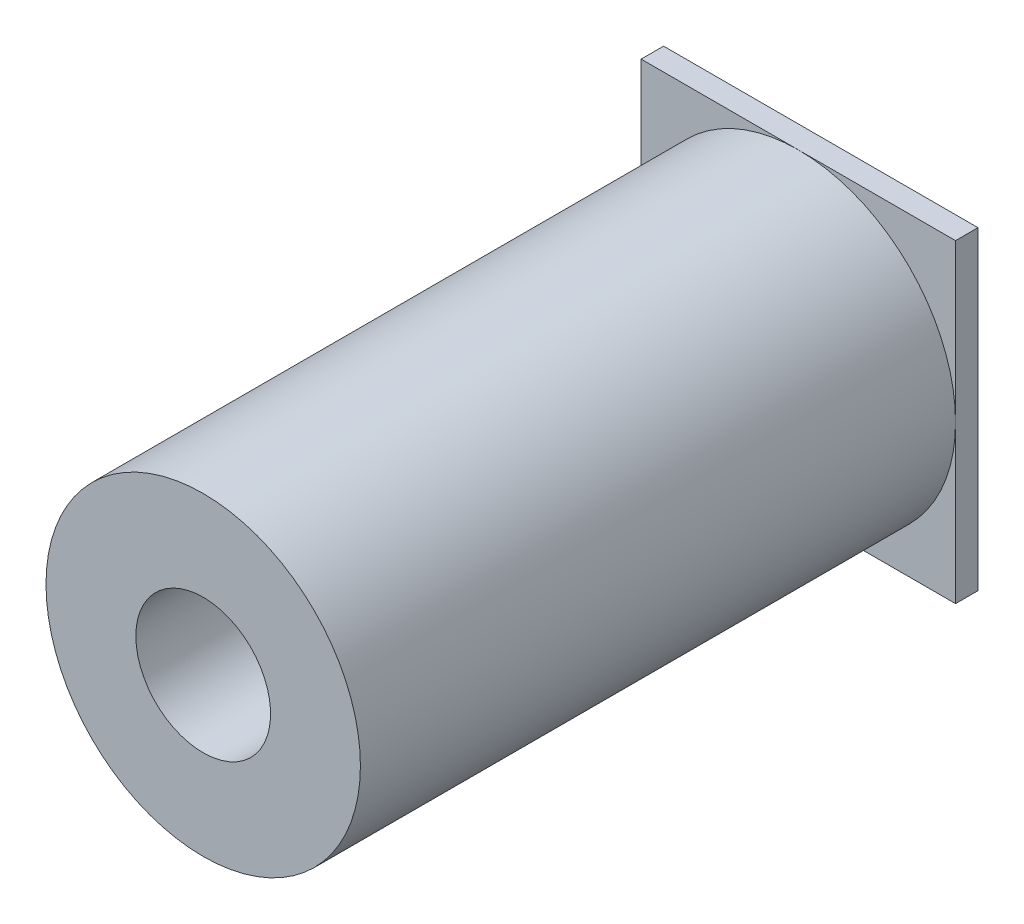
ISO-10303-21;
HEADER;
FILE_DESCRIPTION(('STEP AP214'),'2;1');
FILE_NAME('part.step','',(''),(''),'','','');
FILE_SCHEMA(('AUTOMOTIVE_DESIGN { 1 0 10303 214 1 1 1 1 }'));
ENDSEC;
DATA;
#1=APPLICATION_CONTEXT('core data for automotive mechanical design processes');
#2=APPLICATION_PROTOCOL_DEFINITION('international standard','automotive_design',2000,#1);
#3=PRODUCT_CONTEXT('',#1,'mechanical');
#4=PRODUCT('Part','Part','',(#3));
#5=PRODUCT_RELATED_PRODUCT_CATEGORY('part','',(#4));
#6=PRODUCT_DEFINITION_FORMATION('','',#4);
#7=PRODUCT_DEFINITION_CONTEXT('part definition',#1,'design');
#8=PRODUCT_DEFINITION('design','',#6,#7);
#9=PRODUCT_DEFINITION_SHAPE('','',#8);
#10=(LENGTH_UNIT() NAMED_UNIT(*) SI_UNIT(.MILLI.,.METRE.));
#11=(NAMED_UNIT(*) PLANE_ANGLE_UNIT() SI_UNIT($,.RADIAN.));
#12=(NAMED_UNIT(*) SI_UNIT($,.STERADIAN.) SOLID_ANGLE_UNIT());
#13=UNCERTAINTY_MEASURE_WITH_UNIT(LENGTH_MEASURE(1.E-05),#10,'distance_accuracy_value','');
#14=(GEOMETRIC_REPRESENTATION_CONTEXT(3) GLOBAL_UNCERTAINTY_ASSIGNED_CONTEXT((#13)) GLOBAL_UNIT_ASSIGNED_CONTEXT((#10,
#11,#12)) REPRESENTATION_CONTEXT('',''));
#15=CARTESIAN_POINT('',(0.,0.,0.));
#16=DIRECTION('',(0.,0.,1.));
#17=DIRECTION('',(1.,0.,0.));
#18=AXIS2_PLACEMENT_3D('',#15,#16,#17);
#19=CARTESIAN_POINT('',(0.,0.,2.));
#20=DIRECTION('',(0.,0.,1.));
#21=DIRECTION('',(1.,0.,0.));
#22=AXIS2_PLACEMENT_3D('',#19,#20,#21);
#23=PLANE('',#22);
#24=CARTESIAN_POINT('',(0.,0.,2.));
#25=DIRECTION('',(0.,0.,1.));
#26=DIRECTION('',(1.,0.,0.));
#27=AXIS2_PLACEMENT_3D('',#24,#25,#26);
#28=CIRCLE('',#27,14.);
#29=CARTESIAN_POINT('',(14.,0.,2.));
#30=VERTEX_POINT('',#29);
#31=CARTESIAN_POINT('',(0.,14.,2.));
#32=VERTEX_POINT('',#31);
#33=EDGE_CURVE('E48',#30,#32,#28,.T.);
#34=ORIENTED_EDGE('',*,*,#33,.F.);
#35=DIRECTION('',(0.,1.,0.));
#36=VECTOR('',#35,1.);
#37=CARTESIAN_POINT('',(14.,14.,2.));
#38=LINE('',#37,#36);
#39=CARTESIAN_POINT('',(14.,14.,2.));
#40=VERTEX_POINT('',#39);
#41=EDGE_CURVE('E99',#30,#40,#38,.T.);
#42=ORIENTED_EDGE('',*,*,#41,.T.);
#43=DIRECTION('',(-1.,0.,0.));
#44=VECTOR('',#43,1.);
#45=CARTESIAN_POINT('',(-14.,14.,2.));
#46=LINE('',#45,#44);
#47=EDGE_CURVE('E110',#40,#32,#46,.T.);
#48=ORIENTED_EDGE('',*,*,#47,.T.);
#49=EDGE_LOOP('',(#34,#42,#48));
#50=FACE_BOUND('',#49,.T.);
#51=ADVANCED_FACE('F37',(#50),#23,.T.);
#52=CARTESIAN_POINT('',(-14.,0.,2.));
#53=VERTEX_POINT('',#52);
#54=EDGE_CURVE('E11',#32,#53,#28,.T.);
#55=ORIENTED_EDGE('',*,*,#54,.F.);
#56=CARTESIAN_POINT('',(-14.,14.,2.));
#57=VERTEX_POINT('',#56);
#58=EDGE_CURVE('E98',#32,#57,#46,.T.);
#59=ORIENTED_EDGE('',*,*,#58,.T.);
#60=DIRECTION('',(0.,-1.,0.));
#61=VECTOR('',#60,1.);
#62=CARTESIAN_POINT('',(-14.,14.,2.));
#63=LINE('',#62,#61);
#64=EDGE_CURVE('E121',#57,#53,#63,.T.);
#65=ORIENTED_EDGE('',*,*,#64,.T.);
#66=EDGE_LOOP('',(#55,#59,#65));
#67=FACE_BOUND('',#66,.T.);
#68=ADVANCED_FACE('F154',(#67),#23,.T.);
#69=CARTESIAN_POINT('',(0.,-14.,2.));
#70=VERTEX_POINT('',#69);
#71=EDGE_CURVE('E46',#53,#70,#28,.T.);
#72=ORIENTED_EDGE('',*,*,#71,.F.);
#73=CARTESIAN_POINT('',(-14.,-14.,2.));
#74=VERTEX_POINT('',#73);
#75=EDGE_CURVE('E120',#53,#74,#63,.T.);
#76=ORIENTED_EDGE('',*,*,#75,.T.);
#77=DIRECTION('',(1.,0.,0.));
#78=VECTOR('',#77,1.);
#79=CARTESIAN_POINT('',(-14.,-14.,2.));
#80=LINE('',#79,#78);
#81=EDGE_CURVE('E124',#74,#70,#80,.T.);
#82=ORIENTED_EDGE('',*,*,#81,.T.);
#83=EDGE_LOOP('',(#72,#76,#82));
#84=FACE_BOUND('',#83,.T.);
#85=ADVANCED_FACE('F162',(#84),#23,.T.);
#86=CARTESIAN_POINT('',(14.,14.,2.));
#87=DIRECTION('',(-1.,0.,0.));
#88=DIRECTION('',(0.,-1.,0.));
#89=AXIS2_PLACEMENT_3D('',#86,#87,#88);
#90=PLANE('',#89);
#91=DIRECTION('',(0.,1.,0.));
#92=VECTOR('',#91,1.);
#93=CARTESIAN_POINT('',(14.,14.,0.));
#94=LINE('',#93,#92);
#95=CARTESIAN_POINT('',(14.,-14.,0.));
#96=VERTEX_POINT('',#95);
#97=CARTESIAN_POINT('',(14.,14.,0.));
#98=VERTEX_POINT('',#97);
#99=EDGE_CURVE('E127',#96,#98,#94,.T.);
#100=ORIENTED_EDGE('',*,*,#99,.T.);
#101=DIRECTION('',(0.,0.,-1.));
#102=VECTOR('',#101,1.);
#103=CARTESIAN_POINT('',(14.,14.,2.));
#104=LINE('',#103,#102);
#105=EDGE_CURVE('E41',#40,#98,#104,.T.);
#106=ORIENTED_EDGE('',*,*,#105,.F.);
#107=ORIENTED_EDGE('',*,*,#41,.F.);
#108=CARTESIAN_POINT('',(14.,-14.,2.));
#109=VERTEX_POINT('',#108);
#110=EDGE_CURVE('E91',#109,#30,#38,.T.);
#111=ORIENTED_EDGE('',*,*,#110,.F.);
#112=DIRECTION('',(0.,0.,-1.));
#113=VECTOR('',#112,1.);
#114=CARTESIAN_POINT('',(14.,-14.,2.));
#115=LINE('',#114,#113);
#116=EDGE_CURVE('E126',#109,#96,#115,.T.);
#117=ORIENTED_EDGE('',*,*,#116,.T.);
#118=EDGE_LOOP('',(#100,#106,#107,#111,#117));
#119=FACE_BOUND('',#118,.T.);
#120=ADVANCED_FACE('F39',(#119),#90,.F.);
#121=CARTESIAN_POINT('',(-14.,14.,2.));
#122=DIRECTION('',(0.,-1.,0.));
#123=DIRECTION('',(0.,0.,-1.));
#124=AXIS2_PLACEMENT_3D('',#121,#122,#123);
#125=PLANE('',#124);
#126=DIRECTION('',(-1.,0.,0.));
#127=VECTOR('',#126,1.);
#128=CARTESIAN_POINT('',(-14.,14.,0.));
#129=LINE('',#128,#127);
#130=CARTESIAN_POINT('',(-14.,14.,0.));
#131=VERTEX_POINT('',#130);
#132=EDGE_CURVE('E129',#98,#131,#129,.T.);
#133=ORIENTED_EDGE('',*,*,#132,.T.);
#134=DIRECTION('',(0.,0.,-1.));
#135=VECTOR('',#134,1.);
#136=CARTESIAN_POINT('',(-14.,14.,2.));
#137=LINE('',#136,#135);
#138=EDGE_CURVE('E115',#57,#131,#137,.T.);
#139=ORIENTED_EDGE('',*,*,#138,.F.);
#140=ORIENTED_EDGE('',*,*,#58,.F.);
#141=ORIENTED_EDGE('',*,*,#47,.F.);
#142=ORIENTED_EDGE('',*,*,#105,.T.);
#143=EDGE_LOOP('',(#133,#139,#140,#141,#142));
#144=FACE_BOUND('',#143,.T.);
#145=ADVANCED_FACE('F155',(#144),#125,.F.);
#146=CARTESIAN_POINT('',(-14.,14.,2.));
#147=DIRECTION('',(1.,0.,0.));
#148=DIRECTION('',(0.,1.,0.));
#149=AXIS2_PLACEMENT_3D('',#146,#147,#148);
#150=PLANE('',#149);
#151=DIRECTION('',(0.,-1.,0.));
#152=VECTOR('',#151,1.);
#153=CARTESIAN_POINT('',(-14.,14.,0.));
#154=LINE('',#153,#152);
#155=CARTESIAN_POINT('',(-14.,-14.,0.));
#156=VERTEX_POINT('',#155);
#157=EDGE_CURVE('E131',#131,#156,#154,.T.);
#158=ORIENTED_EDGE('',*,*,#157,.T.);
#159=DIRECTION('',(0.,0.,-1.));
#160=VECTOR('',#159,1.);
#161=CARTESIAN_POINT('',(-14.,-14.,2.));
#162=LINE('',#161,#160);
#163=EDGE_CURVE('E135',#74,#156,#162,.T.);
#164=ORIENTED_EDGE('',*,*,#163,.F.);
#165=ORIENTED_EDGE('',*,*,#75,.F.);
#166=ORIENTED_EDGE('',*,*,#64,.F.);
#167=ORIENTED_EDGE('',*,*,#138,.T.);
#168=EDGE_LOOP('',(#158,#164,#165,#166,#167));
#169=FACE_BOUND('',#168,.T.);
#170=ADVANCED_FACE('F142',(#169),#150,.F.);
#171=CARTESIAN_POINT('',(-14.,-14.,2.));
#172=DIRECTION('',(0.,1.,0.));
#173=DIRECTION('',(0.,0.,1.));
#174=AXIS2_PLACEMENT_3D('',#171,#172,#173);
#175=PLANE('',#174);
#176=DIRECTION('',(1.,0.,0.));
#177=VECTOR('',#176,1.);
#178=CARTESIAN_POINT('',(-14.,-14.,0.));
#179=LINE('',#178,#177);
#180=EDGE_CURVE('E108',#156,#96,#179,.T.);
#181=ORIENTED_EDGE('',*,*,#180,.T.);
#182=ORIENTED_EDGE('',*,*,#116,.F.);
#183=EDGE_CURVE('E94',#70,#109,#80,.T.);
#184=ORIENTED_EDGE('',*,*,#183,.F.);
#185=ORIENTED_EDGE('',*,*,#81,.F.);
#186=ORIENTED_EDGE('',*,*,#163,.T.);
#187=EDGE_LOOP('',(#181,#182,#184,#185,#186));
#188=FACE_BOUND('',#187,.T.);
#189=ADVANCED_FACE('F151',(#188),#175,.F.);
#190=EDGE_CURVE('E55',#70,#30,#28,.T.);
#191=ORIENTED_EDGE('',*,*,#190,.F.);
#192=ORIENTED_EDGE('',*,*,#183,.T.);
#193=ORIENTED_EDGE('',*,*,#110,.T.);
#194=EDGE_LOOP('',(#191,#192,#193));
#195=FACE_BOUND('',#194,.T.);
#196=ADVANCED_FACE('F93',(#195),#23,.T.);
#197=CARTESIAN_POINT('',(0.,0.,0.));
#198=DIRECTION('',(0.,0.,1.));
#199=DIRECTION('',(1.,0.,0.));
#200=AXIS2_PLACEMENT_3D('',#197,#198,#199);
#201=PLANE('',#200);
#202=CARTESIAN_POINT('',(0.,0.,0.));
#203=DIRECTION('',(0.,0.,-1.));
#204=DIRECTION('',(-1.,0.,0.));
#205=AXIS2_PLACEMENT_3D('',#202,#203,#204);
#206=CIRCLE('',#205,6.);
#207=CARTESIAN_POINT('',(-6.,0.,0.));
#208=VERTEX_POINT('',#207);
#209=EDGE_CURVE('E283',#208,#208,#206,.T.);
#210=ORIENTED_EDGE('',*,*,#209,.F.);
#211=EDGE_LOOP('',(#210));
#212=FACE_BOUND('',#211,.T.);
#213=ORIENTED_EDGE('',*,*,#99,.F.);
#214=ORIENTED_EDGE('',*,*,#180,.F.);
#215=ORIENTED_EDGE('',*,*,#157,.F.);
#216=ORIENTED_EDGE('',*,*,#132,.F.);
#217=EDGE_LOOP('',(#213,#214,#215,#216));
#218=FACE_BOUND('',#217,.T.);
#219=ADVANCED_FACE('F149',(#212,#218),#201,.F.);
#220=CARTESIAN_POINT('',(0.,0.,55.));
#221=DIRECTION('',(0.,0.,-1.));
#222=DIRECTION('',(-1.,0.,0.));
#223=AXIS2_PLACEMENT_3D('',#220,#221,#222);
#224=CYLINDRICAL_SURFACE('',#223,14.);
#225=CARTESIAN_POINT('',(0.,0.,55.));
#226=DIRECTION('',(0.,0.,1.));
#227=DIRECTION('',(1.,0.,0.));
#228=AXIS2_PLACEMENT_3D('',#225,#226,#227);
#229=CIRCLE('',#228,14.);
#230=CARTESIAN_POINT('',(14.,0.,55.));
#231=VERTEX_POINT('',#230);
#232=EDGE_CURVE('E112',#231,#231,#229,.T.);
#233=ORIENTED_EDGE('',*,*,#232,.F.);
#234=EDGE_LOOP('',(#233));
#235=FACE_BOUND('',#234,.T.);
#236=ORIENTED_EDGE('',*,*,#33,.T.);
#237=ORIENTED_EDGE('',*,*,#54,.T.);
#238=ORIENTED_EDGE('',*,*,#71,.T.);
#239=ORIENTED_EDGE('',*,*,#190,.T.);
#240=EDGE_LOOP('',(#236,#237,#238,#239));
#241=FACE_BOUND('',#240,.T.);
#242=ADVANCED_FACE('F114',(#235,#241),#224,.T.);
#243=CARTESIAN_POINT('',(0.,0.,55.));
#244=DIRECTION('',(0.,0.,1.));
#245=DIRECTION('',(1.,0.,0.));
#246=AXIS2_PLACEMENT_3D('',#243,#244,#245);
#247=PLANE('',#246);
#248=CARTESIAN_POINT('',(0.,0.,55.));
#249=DIRECTION('',(0.,0.,-1.));
#250=DIRECTION('',(-1.,0.,0.));
#251=AXIS2_PLACEMENT_3D('',#248,#249,#250);
#252=CIRCLE('',#251,6.);
#253=CARTESIAN_POINT('',(-6.,0.,55.));
#254=VERTEX_POINT('',#253);
#255=EDGE_CURVE('E113',#254,#254,#252,.T.);
#256=ORIENTED_EDGE('',*,*,#255,.T.);
#257=EDGE_LOOP('',(#256));
#258=FACE_BOUND('',#257,.T.);
#259=ORIENTED_EDGE('',*,*,#232,.T.);
#260=EDGE_LOOP('',(#259));
#261=FACE_BOUND('',#260,.T.);
#262=ADVANCED_FACE('F221',(#258,#261),#247,.T.);
#263=CARTESIAN_POINT('',(0.,0.,55.));
#264=DIRECTION('',(0.,0.,-1.));
#265=DIRECTION('',(-1.,0.,0.));
#266=AXIS2_PLACEMENT_3D('',#263,#264,#265);
#267=CYLINDRICAL_SURFACE('',#266,6.);
#268=ORIENTED_EDGE('',*,*,#255,.F.);
#269=EDGE_LOOP('',(#268));
#270=FACE_BOUND('',#269,.T.);
#271=ORIENTED_EDGE('',*,*,#209,.T.);
#272=EDGE_LOOP('',(#271));
#273=FACE_BOUND('',#272,.T.);
#274=ADVANCED_FACE('F239',(#270,#273),#267,.F.);
#275=CLOSED_SHELL('',(#51,#68,#85,#120,#145,#170,#189,#196,#219,#242,#262,#274));
#276=MANIFOLD_SOLID_BREP('B2',#275);
#277=ADVANCED_BREP_SHAPE_REPRESENTATION('',(#18,#276),#14);
#278=SHAPE_DEFINITION_REPRESENTATION(#9,#277);
ENDSEC;
END-ISO-10303-21;
